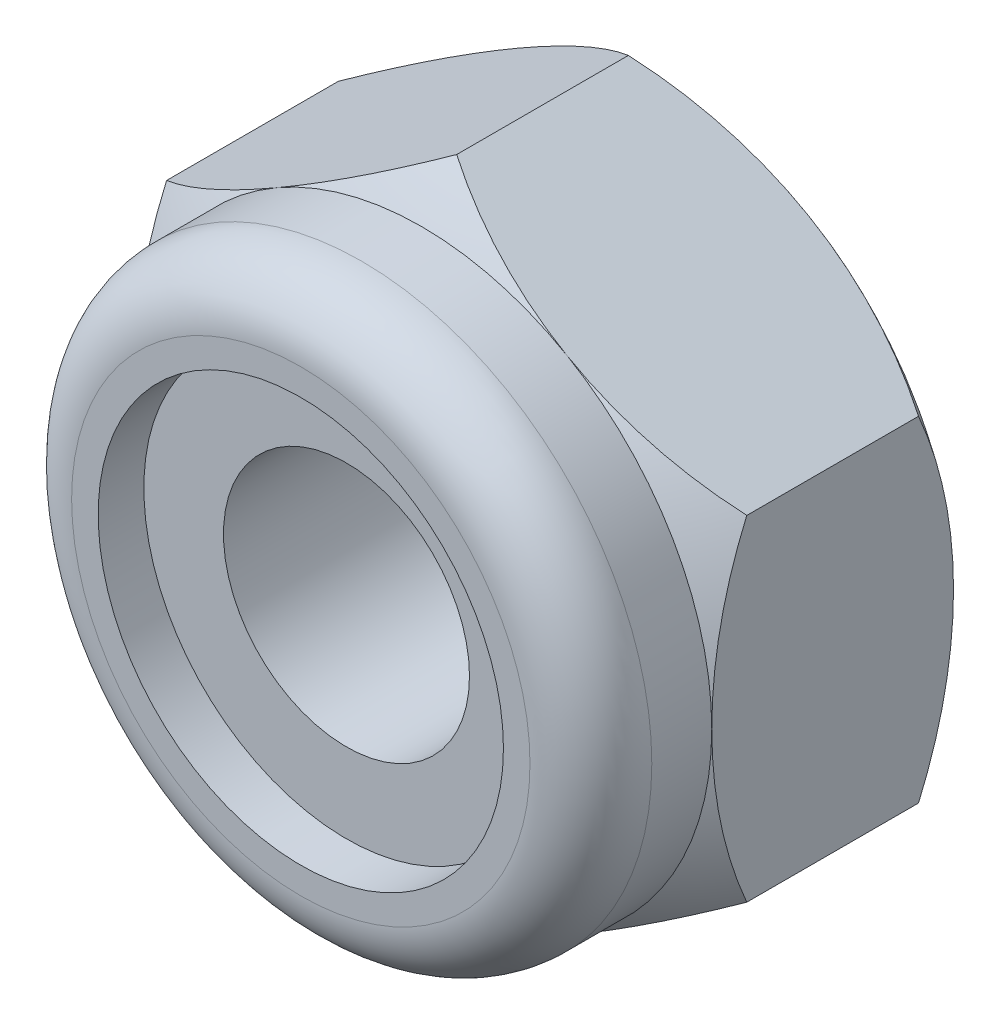
ISO-10303-21;
HEADER;
FILE_DESCRIPTION(('STEP AP214'),'2;1');
FILE_NAME('part.step','',(''),(''),'','','');
FILE_SCHEMA(('AUTOMOTIVE_DESIGN { 1 0 10303 214 1 1 1 1 }'));
ENDSEC;
DATA;
#1=APPLICATION_CONTEXT('core data for automotive mechanical design processes');
#2=APPLICATION_PROTOCOL_DEFINITION('international standard','automotive_design',2000,#1);
#3=PRODUCT_CONTEXT('',#1,'mechanical');
#4=PRODUCT('Part','Part','',(#3));
#5=PRODUCT_RELATED_PRODUCT_CATEGORY('part','',(#4));
#6=PRODUCT_DEFINITION_FORMATION('','',#4);
#7=PRODUCT_DEFINITION_CONTEXT('part definition',#1,'design');
#8=PRODUCT_DEFINITION('design','',#6,#7);
#9=PRODUCT_DEFINITION_SHAPE('','',#8);
#10=(LENGTH_UNIT() NAMED_UNIT(*) SI_UNIT(.MILLI.,.METRE.));
#11=(NAMED_UNIT(*) PLANE_ANGLE_UNIT() SI_UNIT($,.RADIAN.));
#12=(NAMED_UNIT(*) SI_UNIT($,.STERADIAN.) SOLID_ANGLE_UNIT());
#13=UNCERTAINTY_MEASURE_WITH_UNIT(LENGTH_MEASURE(1.E-05),#10,'distance_accuracy_value','');
#14=(GEOMETRIC_REPRESENTATION_CONTEXT(3) GLOBAL_UNCERTAINTY_ASSIGNED_CONTEXT((#13)) GLOBAL_UNIT_ASSIGNED_CONTEXT((#10,
#11,#12)) REPRESENTATION_CONTEXT('',''));
#15=CARTESIAN_POINT('',(0.,0.,0.));
#16=DIRECTION('',(0.,0.,1.));
#17=DIRECTION('',(1.,0.,0.));
#18=AXIS2_PLACEMENT_3D('',#15,#16,#17);
#19=CARTESIAN_POINT('',(0.,0.,4.953125));
#20=DIRECTION('',(0.,0.,1.));
#21=DIRECTION('',(1.,0.,0.));
#22=AXIS2_PLACEMENT_3D('',#19,#20,#21);
#23=TOROIDAL_SURFACE('',#22,3.7625,1.);
#24=CARTESIAN_POINT('',(0.,0.,4.953125));
#25=DIRECTION('',(0.,0.,-1.));
#26=DIRECTION('',(-1.,0.,0.));
#27=AXIS2_PLACEMENT_3D('',#24,#25,#26);
#28=CIRCLE('',#27,4.7625);
#29=CARTESIAN_POINT('',(-4.7625,0.,4.953125));
#30=VERTEX_POINT('',#29);
#31=EDGE_CURVE('E125',#30,#30,#28,.T.);
#32=ORIENTED_EDGE('',*,*,#31,.F.);
#33=EDGE_LOOP('',(#32));
#34=FACE_BOUND('',#33,.T.);
#35=CARTESIAN_POINT('',(0.,0.,5.953125));
#36=DIRECTION('',(0.,0.,-1.));
#37=DIRECTION('',(1.,0.,0.));
#38=AXIS2_PLACEMENT_3D('',#35,#36,#37);
#39=CIRCLE('',#38,3.7625);
#40=CARTESIAN_POINT('',(-3.7625,0.,5.953125));
#41=VERTEX_POINT('',#40);
#42=CARTESIAN_POINT('',(3.7625,0.,5.953125));
#43=VERTEX_POINT('',#42);
#44=EDGE_CURVE('E115',#41,#43,#39,.F.);
#45=ORIENTED_EDGE('',*,*,#44,.F.);
#46=CARTESIAN_POINT('',(0.,0.,5.953125));
#47=DIRECTION('',(0.,0.,-1.));
#48=DIRECTION('',(-1.,0.,0.));
#49=AXIS2_PLACEMENT_3D('',#46,#47,#48);
#50=CIRCLE('',#49,3.7625);
#51=EDGE_CURVE('E119',#43,#41,#50,.F.);
#52=ORIENTED_EDGE('',*,*,#51,.F.);
#53=EDGE_LOOP('',(#45,#52));
#54=FACE_BOUND('',#53,.T.);
#55=ADVANCED_FACE('F17',(#34,#54),#23,.T.);
#56=CARTESIAN_POINT('',(0.,0.,5.953125));
#57=DIRECTION('',(0.,0.,1.));
#58=DIRECTION('',(1.,0.,0.));
#59=AXIS2_PLACEMENT_3D('',#56,#57,#58);
#60=PLANE('',#59);
#61=CARTESIAN_POINT('',(0.,0.,5.953125));
#62=DIRECTION('',(0.,0.,1.));
#63=DIRECTION('',(1.,0.,0.));
#64=AXIS2_PLACEMENT_3D('',#61,#62,#63);
#65=CIRCLE('',#64,3.32676299779793);
#66=CARTESIAN_POINT('',(3.32676299779793,0.,5.953125));
#67=VERTEX_POINT('',#66);
#68=EDGE_CURVE('E271',#67,#67,#65,.F.);
#69=ORIENTED_EDGE('',*,*,#68,.T.);
#70=EDGE_LOOP('',(#69));
#71=FACE_BOUND('',#70,.T.);
#72=ORIENTED_EDGE('',*,*,#51,.T.);
#73=ORIENTED_EDGE('',*,*,#44,.T.);
#74=EDGE_LOOP('',(#72,#73));
#75=FACE_BOUND('',#74,.T.);
#76=ADVANCED_FACE('F124',(#71,#75),#60,.T.);
#77=CARTESIAN_POINT('',(0.,0.,5.953125));
#78=DIRECTION('',(0.,0.,-1.));
#79=DIRECTION('',(-1.,0.,0.));
#80=AXIS2_PLACEMENT_3D('',#77,#78,#79);
#81=CYLINDRICAL_SURFACE('',#80,4.7625);
#82=ORIENTED_EDGE('',*,*,#31,.T.);
#83=EDGE_LOOP('',(#82));
#84=FACE_BOUND('',#83,.T.);
#85=CARTESIAN_POINT('',(0.,0.,3.96875000000001));
#86=DIRECTION('',(0.,0.,-1.));
#87=DIRECTION('',(-1.,0.,0.));
#88=AXIS2_PLACEMENT_3D('',#85,#86,#87);
#89=CIRCLE('',#88,4.7625);
#90=CARTESIAN_POINT('',(2.38124999999999,-4.1244459855234,3.96875000000001));
#91=VERTEX_POINT('',#90);
#92=CARTESIAN_POINT('',(-2.38125,-4.12444598552339,3.96875000000002));
#93=VERTEX_POINT('',#92);
#94=EDGE_CURVE('E108',#91,#93,#89,.T.);
#95=ORIENTED_EDGE('',*,*,#94,.F.);
#96=CARTESIAN_POINT('',(0.,0.,3.96875000000001));
#97=DIRECTION('',(0.,0.,-1.));
#98=DIRECTION('',(-1.,0.,0.));
#99=AXIS2_PLACEMENT_3D('',#96,#97,#98);
#100=CIRCLE('',#99,4.7625);
#101=CARTESIAN_POINT('',(4.76249999999074,0.,3.96875000000645));
#102=VERTEX_POINT('',#101);
#103=EDGE_CURVE('E257',#102,#91,#100,.T.);
#104=ORIENTED_EDGE('',*,*,#103,.F.);
#105=CARTESIAN_POINT('',(0.,0.,3.96875000000001));
#106=DIRECTION('',(0.,0.,-1.));
#107=DIRECTION('',(-1.,0.,0.));
#108=AXIS2_PLACEMENT_3D('',#105,#106,#107);
#109=CIRCLE('',#108,4.7625);
#110=CARTESIAN_POINT('',(2.38125,4.12444598552339,3.96875000000001));
#111=VERTEX_POINT('',#110);
#112=EDGE_CURVE('E259',#111,#102,#109,.T.);
#113=ORIENTED_EDGE('',*,*,#112,.F.);
#114=CARTESIAN_POINT('',(0.,0.,3.96875000000001));
#115=DIRECTION('',(0.,0.,-1.));
#116=DIRECTION('',(-1.,0.,0.));
#117=AXIS2_PLACEMENT_3D('',#114,#115,#116);
#118=CIRCLE('',#117,4.7625);
#119=CARTESIAN_POINT('',(-2.38125,4.12444598552339,3.96875000000001));
#120=VERTEX_POINT('',#119);
#121=EDGE_CURVE('E262',#120,#111,#118,.T.);
#122=ORIENTED_EDGE('',*,*,#121,.F.);
#123=CARTESIAN_POINT('',(0.,0.,3.96875000000001));
#124=DIRECTION('',(0.,0.,-1.));
#125=DIRECTION('',(-1.,0.,0.));
#126=AXIS2_PLACEMENT_3D('',#123,#124,#125);
#127=CIRCLE('',#126,4.7625);
#128=CARTESIAN_POINT('',(-4.76249999999074,0.,3.96875000000645));
#129=VERTEX_POINT('',#128);
#130=EDGE_CURVE('E265',#129,#120,#127,.T.);
#131=ORIENTED_EDGE('',*,*,#130,.F.);
#132=CARTESIAN_POINT('',(0.,0.,3.96875000000001));
#133=DIRECTION('',(0.,0.,-1.));
#134=DIRECTION('',(-1.,0.,0.));
#135=AXIS2_PLACEMENT_3D('',#132,#133,#134);
#136=CIRCLE('',#135,4.7625);
#137=EDGE_CURVE('E268',#93,#129,#136,.T.);
#138=ORIENTED_EDGE('',*,*,#137,.F.);
#139=EDGE_LOOP('',(#95,#104,#113,#122,#131,#138));
#140=FACE_BOUND('',#139,.T.);
#141=ADVANCED_FACE('F143',(#84,#140),#81,.T.);
#142=CARTESIAN_POINT('',(0.,0.,5.953125));
#143=DIRECTION('',(0.,0.,1.));
#144=DIRECTION('',(1.,0.,0.));
#145=AXIS2_PLACEMENT_3D('',#142,#143,#144);
#146=CYLINDRICAL_SURFACE('',#145,3.32676299779793);
#147=CARTESIAN_POINT('',(0.,0.,5.203125));
#148=DIRECTION('',(0.,0.,1.));
#149=DIRECTION('',(1.,0.,0.));
#150=AXIS2_PLACEMENT_3D('',#147,#148,#149);
#151=CIRCLE('',#150,3.32676299779793);
#152=CARTESIAN_POINT('',(3.32676299779793,0.,5.203125));
#153=VERTEX_POINT('',#152);
#154=EDGE_CURVE('E254',#153,#153,#151,.F.);
#155=ORIENTED_EDGE('',*,*,#154,.T.);
#156=EDGE_LOOP('',(#155));
#157=FACE_BOUND('',#156,.T.);
#158=ORIENTED_EDGE('',*,*,#68,.F.);
#159=EDGE_LOOP('',(#158));
#160=FACE_BOUND('',#159,.T.);
#161=ADVANCED_FACE('F278',(#157,#160),#146,.F.);
#162=CARTESIAN_POINT('',(0.,0.,-2.89662617308756));
#163=DIRECTION('',(1.,0.,0.));
#164=DIRECTION('',(0.,-0.514062280042824,0.857752861981336));
#165=AXIS2_PLACEMENT_3D('',#162,#163,#164);
#166=SPHERICAL_SURFACE('',#165,8.35552489362569);
#167=CARTESIAN_POINT('',(2.38125,-4.12444598552339,-2.89662617308756));
#168=DIRECTION('',(0.5,-0.866025403784439,0.));
#169=DIRECTION('',(0.866025403784439,0.5,0.));
#170=AXIS2_PLACEMENT_3D('',#167,#168,#169);
#171=CIRCLE('',#170,6.86537617308758);
#172=CARTESIAN_POINT('',(3.7397602375977E-11,-5.49926131405278,3.39407499989476));
#173=VERTEX_POINT('',#172);
#174=EDGE_CURVE('E249',#91,#173,#171,.T.);
#175=ORIENTED_EDGE('',*,*,#174,.F.);
#176=ORIENTED_EDGE('',*,*,#94,.T.);
#177=CARTESIAN_POINT('',(-2.38125,-4.12444598552339,-2.89662617308756));
#178=DIRECTION('',(-0.5,-0.866025403784439,0.));
#179=DIRECTION('',(0.866025403784439,-0.5,0.));
#180=AXIS2_PLACEMENT_3D('',#177,#178,#179);
#181=CIRCLE('',#180,6.86537617308758);
#182=EDGE_CURVE('E245',#173,#93,#181,.T.);
#183=ORIENTED_EDGE('',*,*,#182,.F.);
#184=EDGE_LOOP('',(#175,#176,#183));
#185=FACE_BOUND('',#184,.T.);
#186=ADVANCED_FACE('F151',(#185),#166,.T.);
#187=CARTESIAN_POINT('',(0.,0.,-2.89662617308763));
#188=DIRECTION('',(1.,0.,0.));
#189=DIRECTION('',(0.,0.00324586478599379,0.999994732167021));
#190=AXIS2_PLACEMENT_3D('',#187,#188,#189);
#191=SPHERICAL_SURFACE('',#190,8.35552489362577);
#192=CARTESIAN_POINT('',(-2.38124999999997,-4.12444598552341,-2.89662617308763));
#193=DIRECTION('',(-0.5,-0.866025403784439,0.));
#194=DIRECTION('',(0.866025403784439,-0.5,0.));
#195=AXIS2_PLACEMENT_3D('',#192,#193,#194);
#196=CIRCLE('',#195,6.86537617308765);
#197=CARTESIAN_POINT('',(-4.7625,-2.74963065700324,3.39407499991903));
#198=VERTEX_POINT('',#197);
#199=EDGE_CURVE('E243',#93,#198,#196,.T.);
#200=ORIENTED_EDGE('',*,*,#199,.F.);
#201=ORIENTED_EDGE('',*,*,#137,.T.);
#202=CARTESIAN_POINT('',(-4.7625,0.,-2.89662617308763));
#203=DIRECTION('',(1.,0.,0.));
#204=DIRECTION('',(0.,0.,-1.));
#205=AXIS2_PLACEMENT_3D('',#202,#203,#204);
#206=CIRCLE('',#205,6.86537617308764);
#207=EDGE_CURVE('E239',#198,#129,#206,.F.);
#208=ORIENTED_EDGE('',*,*,#207,.F.);
#209=EDGE_LOOP('',(#200,#201,#208));
#210=FACE_BOUND('',#209,.T.);
#211=ADVANCED_FACE('F391',(#210),#191,.T.);
#212=CARTESIAN_POINT('',(0.,0.,-2.8966261730876));
#213=DIRECTION('',(1.,0.,0.));
#214=DIRECTION('',(0.,0.517754599312685,0.855529178281233));
#215=AXIS2_PLACEMENT_3D('',#212,#213,#214);
#216=SPHERICAL_SURFACE('',#215,8.35552489362575);
#217=CARTESIAN_POINT('',(-4.76249999998147,0.,-2.8966261730876));
#218=DIRECTION('',(1.,0.,0.));
#219=DIRECTION('',(0.,0.,-1.));
#220=AXIS2_PLACEMENT_3D('',#217,#218,#219);
#221=CIRCLE('',#220,6.86537617310048);
#222=CARTESIAN_POINT('',(-4.76249999994795,2.74963065704565,3.39407499993991));
#223=VERTEX_POINT('',#222);
#224=EDGE_CURVE('E237',#129,#223,#221,.F.);
#225=ORIENTED_EDGE('',*,*,#224,.F.);
#226=ORIENTED_EDGE('',*,*,#130,.T.);
#227=CARTESIAN_POINT('',(-2.38125,4.12444598552339,-2.8966261730876));
#228=DIRECTION('',(-0.5,0.866025403784439,0.));
#229=DIRECTION('',(-0.866025403784439,-0.5,0.));
#230=AXIS2_PLACEMENT_3D('',#227,#228,#229);
#231=CIRCLE('',#230,6.86537617308761);
#232=EDGE_CURVE('E233',#223,#120,#231,.T.);
#233=ORIENTED_EDGE('',*,*,#232,.F.);
#234=EDGE_LOOP('',(#225,#226,#233));
#235=FACE_BOUND('',#234,.T.);
#236=ADVANCED_FACE('F403',(#235),#216,.T.);
#237=CARTESIAN_POINT('',(0.,0.,-2.89662617308755));
#238=DIRECTION('',(1.,0.,0.));
#239=DIRECTION('',(0.,0.658959645209422,0.752178294013775));
#240=AXIS2_PLACEMENT_3D('',#237,#238,#239);
#241=SPHERICAL_SURFACE('',#240,8.35552489362568);
#242=ORIENTED_EDGE('',*,*,#121,.T.);
#243=CARTESIAN_POINT('',(2.38125,4.12444598552339,-2.89662617308755));
#244=DIRECTION('',(0.5,0.866025403784439,0.));
#245=DIRECTION('',(-0.866025403784439,0.5,0.));
#246=AXIS2_PLACEMENT_3D('',#243,#244,#245);
#247=CIRCLE('',#246,6.86537617308756);
#248=CARTESIAN_POINT('',(4.83339496898383E-11,5.49926131400328,3.39407499993803));
#249=VERTEX_POINT('',#248);
#250=EDGE_CURVE('E227',#249,#111,#247,.T.);
#251=ORIENTED_EDGE('',*,*,#250,.F.);
#252=CARTESIAN_POINT('',(-2.38125,4.12444598552339,-2.89662617308755));
#253=DIRECTION('',(-0.5,0.866025403784439,0.));
#254=DIRECTION('',(-0.866025403784439,-0.5,0.));
#255=AXIS2_PLACEMENT_3D('',#252,#253,#254);
#256=CIRCLE('',#255,6.86537617308756);
#257=EDGE_CURVE('E231',#120,#249,#256,.T.);
#258=ORIENTED_EDGE('',*,*,#257,.F.);
#259=EDGE_LOOP('',(#242,#251,#258));
#260=FACE_BOUND('',#259,.T.);
#261=ADVANCED_FACE('F341',(#260),#241,.T.);
#262=CARTESIAN_POINT('',(0.,0.,-2.89662617308758));
#263=DIRECTION('',(1.,0.,0.));
#264=DIRECTION('',(0.,0.517754599312686,0.855529178281232));
#265=AXIS2_PLACEMENT_3D('',#262,#263,#264);
#266=SPHERICAL_SURFACE('',#265,8.35552489362574);
#267=ORIENTED_EDGE('',*,*,#112,.T.);
#268=CARTESIAN_POINT('',(4.76250000000002,0.,-2.89662617308758));
#269=DIRECTION('',(1.,0.,0.));
#270=DIRECTION('',(0.,0.,-1.));
#271=AXIS2_PLACEMENT_3D('',#268,#269,#270);
#272=CIRCLE('',#271,6.86537617308761);
#273=CARTESIAN_POINT('',(4.76250000000002,2.74963065695978,3.39407499993802));
#274=VERTEX_POINT('',#273);
#275=EDGE_CURVE('E221',#274,#102,#272,.T.);
#276=ORIENTED_EDGE('',*,*,#275,.F.);
#277=CARTESIAN_POINT('',(2.38125,4.12444598552339,-2.89662617308758));
#278=DIRECTION('',(0.5,0.866025403784439,0.));
#279=DIRECTION('',(-0.866025403784439,0.5,0.));
#280=AXIS2_PLACEMENT_3D('',#277,#278,#279);
#281=CIRCLE('',#280,6.8653761730876);
#282=EDGE_CURVE('E225',#111,#274,#281,.T.);
#283=ORIENTED_EDGE('',*,*,#282,.F.);
#284=EDGE_LOOP('',(#267,#276,#283));
#285=FACE_BOUND('',#284,.T.);
#286=ADVANCED_FACE('F330',(#285),#266,.T.);
#287=CARTESIAN_POINT('',(0.,0.,-2.89662617308762));
#288=DIRECTION('',(1.,0.,0.));
#289=DIRECTION('',(0.,0.00324586478599379,0.999994732167021));
#290=AXIS2_PLACEMENT_3D('',#287,#288,#289);
#291=SPHERICAL_SURFACE('',#290,8.35552489362576);
#292=ORIENTED_EDGE('',*,*,#103,.T.);
#293=CARTESIAN_POINT('',(2.38124999999997,-4.12444598552341,-2.89662617308762));
#294=DIRECTION('',(0.5,-0.866025403784439,0.));
#295=DIRECTION('',(0.866025403784439,0.5,0.));
#296=AXIS2_PLACEMENT_3D('',#293,#294,#295);
#297=CIRCLE('',#296,6.86537617308765);
#298=CARTESIAN_POINT('',(4.76249999998147,-2.74963065704565,3.39407499991453));
#299=VERTEX_POINT('',#298);
#300=EDGE_CURVE('E251',#299,#91,#297,.T.);
#301=ORIENTED_EDGE('',*,*,#300,.F.);
#302=CARTESIAN_POINT('',(4.76249999998147,0.,-2.89662617308762));
#303=DIRECTION('',(1.,0.,0.));
#304=DIRECTION('',(0.,0.,-1.));
#305=AXIS2_PLACEMENT_3D('',#302,#303,#304);
#306=CIRCLE('',#305,6.86537617310049);
#307=EDGE_CURVE('E218',#102,#299,#306,.T.);
#308=ORIENTED_EDGE('',*,*,#307,.F.);
#309=EDGE_LOOP('',(#292,#301,#308));
#310=FACE_BOUND('',#309,.T.);
#311=ADVANCED_FACE('F325',(#310),#291,.T.);
#312=CARTESIAN_POINT('',(2.01930000000001,0.,5.203125));
#313=DIRECTION('',(0.,0.,-1.));
#314=DIRECTION('',(-1.,0.,0.));
#315=AXIS2_PLACEMENT_3D('',#312,#313,#314);
#316=PLANE('',#315);
#317=ORIENTED_EDGE('',*,*,#154,.F.);
#318=EDGE_LOOP('',(#317));
#319=FACE_BOUND('',#318,.T.);
#320=CARTESIAN_POINT('',(0.,0.,5.203125));
#321=DIRECTION('',(0.,0.,1.));
#322=DIRECTION('',(1.,0.,0.));
#323=AXIS2_PLACEMENT_3D('',#320,#321,#322);
#324=CIRCLE('',#323,2.01930000000001);
#325=CARTESIAN_POINT('',(2.01930000000001,0.,5.203125));
#326=VERTEX_POINT('',#325);
#327=EDGE_CURVE('E214',#326,#326,#324,.F.);
#328=ORIENTED_EDGE('',*,*,#327,.T.);
#329=EDGE_LOOP('',(#328));
#330=FACE_BOUND('',#329,.T.);
#331=ADVANCED_FACE('F322',(#319,#330),#316,.F.);
#332=CARTESIAN_POINT('',(2.38125,-4.12444598552339,1.984375));
#333=DIRECTION('',(0.5,-0.866025403784439,0.));
#334=DIRECTION('',(0.866025403784439,0.5,0.));
#335=AXIS2_PLACEMENT_3D('',#332,#333,#334);
#336=PLANE('',#335);
#337=CARTESIAN_POINT('',(2.38125,-4.12444598552339,6.86537617308756));
#338=DIRECTION('',(0.5,-0.866025403784439,0.));
#339=DIRECTION('',(0.866025403784439,0.5,0.));
#340=AXIS2_PLACEMENT_3D('',#337,#338,#339);
#341=CIRCLE('',#340,6.86537617308756);
#342=CARTESIAN_POINT('',(2.38124999999999,-4.1244459855234,0.));
#343=VERTEX_POINT('',#342);
#344=CARTESIAN_POINT('',(3.7397602375977E-11,-5.49926131405278,0.574675000105257));
#345=VERTEX_POINT('',#344);
#346=EDGE_CURVE('E205',#343,#345,#341,.F.);
#347=ORIENTED_EDGE('',*,*,#346,.F.);
#348=CARTESIAN_POINT('',(2.38124999999998,-4.1244459855234,6.8653761730876));
#349=DIRECTION('',(0.5,-0.866025403784439,0.));
#350=DIRECTION('',(0.866025403784439,0.5,0.));
#351=AXIS2_PLACEMENT_3D('',#348,#349,#350);
#352=CIRCLE('',#351,6.8653761730876);
#353=CARTESIAN_POINT('',(4.76249999999999,-2.7496306570403,0.57467500009718));
#354=VERTEX_POINT('',#353);
#355=EDGE_CURVE('E208',#354,#343,#352,.F.);
#356=ORIENTED_EDGE('',*,*,#355,.F.);
#357=DIRECTION('',(0.,0.,-1.));
#358=VECTOR('',#357,1.);
#359=CARTESIAN_POINT('',(4.7625,-2.749630657065,1.984375));
#360=LINE('',#359,#358);
#361=EDGE_CURVE('E217',#299,#354,#360,.T.);
#362=ORIENTED_EDGE('',*,*,#361,.F.);
#363=ORIENTED_EDGE('',*,*,#300,.T.);
#364=ORIENTED_EDGE('',*,*,#174,.T.);
#365=DIRECTION('',(0.,0.,1.));
#366=VECTOR('',#365,1.);
#367=CARTESIAN_POINT('',(7.4795204751954E-11,-5.49926131407437,1.984375));
#368=LINE('',#367,#366);
#369=EDGE_CURVE('E248',#345,#173,#368,.T.);
#370=ORIENTED_EDGE('',*,*,#369,.F.);
#371=EDGE_LOOP('',(#347,#356,#362,#363,#364,#370));
#372=FACE_BOUND('',#371,.T.);
#373=ADVANCED_FACE('F318',(#372),#336,.T.);
#374=CARTESIAN_POINT('',(-2.38125,-4.12444598552339,1.984375));
#375=DIRECTION('',(-0.5,-0.866025403784439,0.));
#376=DIRECTION('',(0.866025403784439,-0.5,0.));
#377=AXIS2_PLACEMENT_3D('',#374,#375,#376);
#378=PLANE('',#377);
#379=CARTESIAN_POINT('',(-2.38124999999997,-4.12444598552341,6.86537617308762));
#380=DIRECTION('',(-0.5,-0.866025403784439,0.));
#381=DIRECTION('',(0.866025403784439,-0.5,0.));
#382=AXIS2_PLACEMENT_3D('',#379,#380,#381);
#383=CIRCLE('',#382,6.86537617308762);
#384=CARTESIAN_POINT('',(-2.38124999999998,-4.1244459855234,0.));
#385=VERTEX_POINT('',#384);
#386=CARTESIAN_POINT('',(-4.7624999999984,-2.74963065700015,0.57467500007843));
#387=VERTEX_POINT('',#386);
#388=EDGE_CURVE('E196',#385,#387,#383,.F.);
#389=ORIENTED_EDGE('',*,*,#388,.F.);
#390=CARTESIAN_POINT('',(-2.38125,-4.12444598552339,6.86537617308756));
#391=DIRECTION('',(-0.5,-0.866025403784439,0.));
#392=DIRECTION('',(0.866025403784439,-0.5,0.));
#393=AXIS2_PLACEMENT_3D('',#390,#391,#392);
#394=CIRCLE('',#393,6.86537617308756);
#395=EDGE_CURVE('E202',#345,#385,#394,.F.);
#396=ORIENTED_EDGE('',*,*,#395,.F.);
#397=ORIENTED_EDGE('',*,*,#369,.T.);
#398=ORIENTED_EDGE('',*,*,#182,.T.);
#399=ORIENTED_EDGE('',*,*,#199,.T.);
#400=DIRECTION('',(0.,0.,1.));
#401=VECTOR('',#400,1.);
#402=CARTESIAN_POINT('',(-4.7625,-2.74963065699089,1.984375));
#403=LINE('',#402,#401);
#404=EDGE_CURVE('E242',#387,#198,#403,.T.);
#405=ORIENTED_EDGE('',*,*,#404,.F.);
#406=EDGE_LOOP('',(#389,#396,#397,#398,#399,#405));
#407=FACE_BOUND('',#406,.T.);
#408=ADVANCED_FACE('F314',(#407),#378,.T.);
#409=CARTESIAN_POINT('',(-4.7625,0.,1.984375));
#410=DIRECTION('',(-1.,0.,0.));
#411=DIRECTION('',(0.,0.,1.));
#412=AXIS2_PLACEMENT_3D('',#409,#410,#411);
#413=PLANE('',#412);
#414=CARTESIAN_POINT('',(-4.76249999999999,0.,6.86537617308759));
#415=DIRECTION('',(1.,0.,0.));
#416=DIRECTION('',(0.,0.,-1.));
#417=AXIS2_PLACEMENT_3D('',#414,#415,#416);
#418=CIRCLE('',#417,6.86537617308759);
#419=CARTESIAN_POINT('',(-4.76249999999651,0.,-2.40324253553137E-12));
#420=VERTEX_POINT('',#419);
#421=CARTESIAN_POINT('',(-4.76249999995721,2.7496306570403,0.574675000064784));
#422=VERTEX_POINT('',#421);
#423=EDGE_CURVE('E193',#420,#422,#418,.T.);
#424=ORIENTED_EDGE('',*,*,#423,.F.);
#425=CARTESIAN_POINT('',(-4.7624999999861,0.,6.86537617308762));
#426=DIRECTION('',(1.,0.,0.));
#427=DIRECTION('',(0.,0.,-1.));
#428=AXIS2_PLACEMENT_3D('',#425,#426,#427);
#429=CIRCLE('',#428,6.86537617309723);
#430=EDGE_CURVE('E199',#387,#420,#429,.T.);
#431=ORIENTED_EDGE('',*,*,#430,.F.);
#432=ORIENTED_EDGE('',*,*,#404,.T.);
#433=ORIENTED_EDGE('',*,*,#207,.T.);
#434=ORIENTED_EDGE('',*,*,#224,.T.);
#435=DIRECTION('',(0.,0.,1.));
#436=VECTOR('',#435,1.);
#437=CARTESIAN_POINT('',(-4.76249999991443,2.749630657065,1.984375));
#438=LINE('',#437,#436);
#439=EDGE_CURVE('E236',#422,#223,#438,.T.);
#440=ORIENTED_EDGE('',*,*,#439,.F.);
#441=EDGE_LOOP('',(#424,#431,#432,#433,#434,#440));
#442=FACE_BOUND('',#441,.T.);
#443=ADVANCED_FACE('F310',(#442),#413,.T.);
#444=CARTESIAN_POINT('',(-2.38125,4.12444598552339,1.984375));
#445=DIRECTION('',(-0.5,0.866025403784439,0.));
#446=DIRECTION('',(-0.866025403784439,-0.5,0.));
#447=AXIS2_PLACEMENT_3D('',#444,#445,#446);
#448=PLANE('',#447);
#449=CARTESIAN_POINT('',(-2.38125,4.12444598552339,6.86537617308756));
#450=DIRECTION('',(-0.5,0.866025403784439,0.));
#451=DIRECTION('',(-0.866025403784439,-0.5,0.));
#452=AXIS2_PLACEMENT_3D('',#449,#450,#451);
#453=CIRCLE('',#452,6.86537617308756);
#454=CARTESIAN_POINT('',(-2.38125,4.12444598552339,0.));
#455=VERTEX_POINT('',#454);
#456=CARTESIAN_POINT('',(4.8334708631359E-11,5.49926131400328,0.574675000061985));
#457=VERTEX_POINT('',#456);
#458=EDGE_CURVE('E187',#455,#457,#453,.F.);
#459=ORIENTED_EDGE('',*,*,#458,.F.);
#460=CARTESIAN_POINT('',(-2.38124999999999,4.12444598552339,6.86537617308758));
#461=DIRECTION('',(-0.5,0.866025403784439,0.));
#462=DIRECTION('',(-0.866025403784439,-0.5,0.));
#463=AXIS2_PLACEMENT_3D('',#460,#461,#462);
#464=CIRCLE('',#463,6.86537617308758);
#465=EDGE_CURVE('E190',#422,#455,#464,.F.);
#466=ORIENTED_EDGE('',*,*,#465,.F.);
#467=ORIENTED_EDGE('',*,*,#439,.T.);
#468=ORIENTED_EDGE('',*,*,#232,.T.);
#469=ORIENTED_EDGE('',*,*,#257,.T.);
#470=DIRECTION('',(0.,0.,1.));
#471=VECTOR('',#470,1.);
#472=CARTESIAN_POINT('',(9.66692004222836E-11,5.49926131397537,1.984375));
#473=LINE('',#472,#471);
#474=EDGE_CURVE('E230',#457,#249,#473,.T.);
#475=ORIENTED_EDGE('',*,*,#474,.F.);
#476=EDGE_LOOP('',(#459,#466,#467,#468,#469,#475));
#477=FACE_BOUND('',#476,.T.);
#478=ADVANCED_FACE('F307',(#477),#448,.T.);
#479=CARTESIAN_POINT('',(2.38125,4.12444598552339,1.984375));
#480=DIRECTION('',(0.5,0.866025403784439,0.));
#481=DIRECTION('',(-0.866025403784439,0.5,0.));
#482=AXIS2_PLACEMENT_3D('',#479,#480,#481);
#483=PLANE('',#482);
#484=CARTESIAN_POINT('',(2.38125,4.12444598552339,6.86537617308756));
#485=DIRECTION('',(0.5,0.866025403784439,0.));
#486=DIRECTION('',(-0.866025403784439,0.5,0.));
#487=AXIS2_PLACEMENT_3D('',#484,#485,#486);
#488=CIRCLE('',#487,6.86537617308756);
#489=CARTESIAN_POINT('',(2.38125,4.12444598552339,0.));
#490=VERTEX_POINT('',#489);
#491=CARTESIAN_POINT('',(4.7625000000072,2.7496306569577,0.574675000066536));
#492=VERTEX_POINT('',#491);
#493=EDGE_CURVE('E38',#490,#492,#488,.F.);
#494=ORIENTED_EDGE('',*,*,#493,.F.);
#495=CARTESIAN_POINT('',(2.38125,4.12444598552339,6.86537617308756));
#496=DIRECTION('',(0.5,0.866025403784439,0.));
#497=DIRECTION('',(-0.866025403784439,0.5,0.));
#498=AXIS2_PLACEMENT_3D('',#495,#496,#497);
#499=CIRCLE('',#498,6.86537617308756);
#500=EDGE_CURVE('E185',#457,#490,#499,.F.);
#501=ORIENTED_EDGE('',*,*,#500,.F.);
#502=ORIENTED_EDGE('',*,*,#474,.T.);
#503=ORIENTED_EDGE('',*,*,#250,.T.);
#504=ORIENTED_EDGE('',*,*,#282,.T.);
#505=DIRECTION('',(0.,0.,-1.));
#506=VECTOR('',#505,1.);
#507=CARTESIAN_POINT('',(4.7625,2.74963065690397,1.984375));
#508=LINE('',#507,#506);
#509=EDGE_CURVE('E224',#492,#274,#508,.F.);
#510=ORIENTED_EDGE('',*,*,#509,.F.);
#511=EDGE_LOOP('',(#494,#501,#502,#503,#504,#510));
#512=FACE_BOUND('',#511,.T.);
#513=ADVANCED_FACE('F303',(#512),#483,.T.);
#514=CARTESIAN_POINT('',(4.7625,0.,1.984375));
#515=DIRECTION('',(1.,0.,0.));
#516=DIRECTION('',(0.,0.,-1.));
#517=AXIS2_PLACEMENT_3D('',#514,#515,#516);
#518=PLANE('',#517);
#519=CARTESIAN_POINT('',(4.76249999999999,0.,6.8653761730876));
#520=DIRECTION('',(1.,0.,0.));
#521=DIRECTION('',(0.,0.,-1.));
#522=AXIS2_PLACEMENT_3D('',#519,#520,#521);
#523=CIRCLE('',#522,6.86537617308759);
#524=CARTESIAN_POINT('',(4.76250000000179,0.,1.25030194531028E-12));
#525=VERTEX_POINT('',#524);
#526=EDGE_CURVE('E211',#525,#354,#523,.F.);
#527=ORIENTED_EDGE('',*,*,#526,.F.);
#528=CARTESIAN_POINT('',(4.76250000000718,0.,6.86537617308758));
#529=DIRECTION('',(1.,0.,0.));
#530=DIRECTION('',(0.,0.,-1.));
#531=AXIS2_PLACEMENT_3D('',#528,#529,#530);
#532=CIRCLE('',#531,6.86537617308258);
#533=EDGE_CURVE('E181',#492,#525,#532,.F.);
#534=ORIENTED_EDGE('',*,*,#533,.F.);
#535=ORIENTED_EDGE('',*,*,#509,.T.);
#536=ORIENTED_EDGE('',*,*,#275,.T.);
#537=ORIENTED_EDGE('',*,*,#307,.T.);
#538=ORIENTED_EDGE('',*,*,#361,.T.);
#539=EDGE_LOOP('',(#527,#534,#535,#536,#537,#538));
#540=FACE_BOUND('',#539,.T.);
#541=ADVANCED_FACE('F299',(#540),#518,.T.);
#542=CARTESIAN_POINT('',(0.,0.,5.953125));
#543=DIRECTION('',(0.,0.,1.));
#544=DIRECTION('',(1.,0.,0.));
#545=AXIS2_PLACEMENT_3D('',#542,#543,#544);
#546=CYLINDRICAL_SURFACE('',#545,2.01930000000001);
#547=CARTESIAN_POINT('',(0.,0.,0.));
#548=DIRECTION('',(0.,0.,1.));
#549=DIRECTION('',(1.,0.,0.));
#550=AXIS2_PLACEMENT_3D('',#547,#548,#549);
#551=CIRCLE('',#550,2.01930000000001);
#552=CARTESIAN_POINT('',(2.01930000000001,0.,0.));
#553=VERTEX_POINT('',#552);
#554=EDGE_CURVE('E178',#553,#553,#551,.T.);
#555=ORIENTED_EDGE('',*,*,#554,.F.);
#556=EDGE_LOOP('',(#555));
#557=FACE_BOUND('',#556,.T.);
#558=ORIENTED_EDGE('',*,*,#327,.F.);
#559=EDGE_LOOP('',(#558));
#560=FACE_BOUND('',#559,.T.);
#561=ADVANCED_FACE('F295',(#557,#560),#546,.F.);
#562=CARTESIAN_POINT('',(0.,0.,6.8653761730876));
#563=DIRECTION('',(1.,0.,0.));
#564=DIRECTION('',(0.,-0.517754599312681,-0.855529178281235));
#565=AXIS2_PLACEMENT_3D('',#562,#563,#564);
#566=SPHERICAL_SURFACE('',#565,8.3555248936257);
#567=ORIENTED_EDGE('',*,*,#355,.T.);
#568=CARTESIAN_POINT('',(0.,0.,0.));
#569=DIRECTION('',(0.,0.,-1.));
#570=DIRECTION('',(-1.,0.,0.));
#571=AXIS2_PLACEMENT_3D('',#568,#569,#570);
#572=CIRCLE('',#571,4.76249999999999);
#573=EDGE_CURVE('E175',#525,#343,#572,.T.);
#574=ORIENTED_EDGE('',*,*,#573,.F.);
#575=ORIENTED_EDGE('',*,*,#526,.T.);
#576=EDGE_LOOP('',(#567,#574,#575));
#577=FACE_BOUND('',#576,.T.);
#578=ADVANCED_FACE('F298',(#577),#566,.T.);
#579=CARTESIAN_POINT('',(0.,0.,6.86537617308756));
#580=DIRECTION('',(1.,0.,0.));
#581=DIRECTION('',(0.,-0.658959645214411,-0.752178294009404));
#582=AXIS2_PLACEMENT_3D('',#579,#580,#581);
#583=SPHERICAL_SURFACE('',#582,8.35552489362568);
#584=ORIENTED_EDGE('',*,*,#395,.T.);
#585=CARTESIAN_POINT('',(0.,0.,0.));
#586=DIRECTION('',(0.,0.,-1.));
#587=DIRECTION('',(-1.,0.,0.));
#588=AXIS2_PLACEMENT_3D('',#585,#586,#587);
#589=CIRCLE('',#588,4.7625);
#590=EDGE_CURVE('E172',#343,#385,#589,.T.);
#591=ORIENTED_EDGE('',*,*,#590,.F.);
#592=ORIENTED_EDGE('',*,*,#346,.T.);
#593=EDGE_LOOP('',(#584,#591,#592));
#594=FACE_BOUND('',#593,.T.);
#595=ADVANCED_FACE('F348',(#594),#583,.T.);
#596=CARTESIAN_POINT('',(0.,0.,6.86537617308762));
#597=DIRECTION('',(1.,0.,0.));
#598=DIRECTION('',(0.,-0.517754599312678,-0.855529178281237));
#599=AXIS2_PLACEMENT_3D('',#596,#597,#598);
#600=SPHERICAL_SURFACE('',#599,8.35552489362571);
#601=CARTESIAN_POINT('',(0.,0.,0.));
#602=DIRECTION('',(0.,0.,-1.));
#603=DIRECTION('',(-1.,0.,0.));
#604=AXIS2_PLACEMENT_3D('',#601,#602,#603);
#605=CIRCLE('',#604,4.76249999999997);
#606=EDGE_CURVE('E169',#385,#420,#605,.T.);
#607=ORIENTED_EDGE('',*,*,#606,.F.);
#608=ORIENTED_EDGE('',*,*,#388,.T.);
#609=ORIENTED_EDGE('',*,*,#430,.T.);
#610=EDGE_LOOP('',(#607,#608,#609));
#611=FACE_BOUND('',#610,.T.);
#612=ADVANCED_FACE('F352',(#611),#600,.T.);
#613=CARTESIAN_POINT('',(0.,0.,6.86537617308758));
#614=DIRECTION('',(1.,0.,0.));
#615=DIRECTION('',(0.,-0.00324586478599368,-0.999994732167021));
#616=AXIS2_PLACEMENT_3D('',#613,#614,#615);
#617=SPHERICAL_SURFACE('',#616,8.3555248936257);
#618=ORIENTED_EDGE('',*,*,#465,.T.);
#619=CARTESIAN_POINT('',(0.,0.,0.));
#620=DIRECTION('',(0.,0.,-1.));
#621=DIRECTION('',(-1.,0.,0.));
#622=AXIS2_PLACEMENT_3D('',#619,#620,#621);
#623=CIRCLE('',#622,4.76250000000001);
#624=EDGE_CURVE('E166',#420,#455,#623,.T.);
#625=ORIENTED_EDGE('',*,*,#624,.F.);
#626=ORIENTED_EDGE('',*,*,#423,.T.);
#627=EDGE_LOOP('',(#618,#625,#626));
#628=FACE_BOUND('',#627,.T.);
#629=ADVANCED_FACE('F356',(#628),#617,.T.);
#630=CARTESIAN_POINT('',(0.,0.,6.86537617308756));
#631=DIRECTION('',(1.,0.,0.));
#632=DIRECTION('',(0.,0.51406228004279,-0.857752861981356));
#633=AXIS2_PLACEMENT_3D('',#630,#631,#632);
#634=SPHERICAL_SURFACE('',#633,8.35552489362568);
#635=ORIENTED_EDGE('',*,*,#500,.T.);
#636=CARTESIAN_POINT('',(0.,0.,0.));
#637=DIRECTION('',(0.,0.,-1.));
#638=DIRECTION('',(-1.,0.,0.));
#639=AXIS2_PLACEMENT_3D('',#636,#637,#638);
#640=CIRCLE('',#639,4.76250000000001);
#641=EDGE_CURVE('E29',#455,#490,#640,.T.);
#642=ORIENTED_EDGE('',*,*,#641,.F.);
#643=ORIENTED_EDGE('',*,*,#458,.T.);
#644=EDGE_LOOP('',(#635,#642,#643));
#645=FACE_BOUND('',#644,.T.);
#646=ADVANCED_FACE('F291',(#645),#634,.T.);
#647=CARTESIAN_POINT('',(0.,0.,6.86537617308756));
#648=DIRECTION('',(1.,0.,0.));
#649=DIRECTION('',(0.,-0.00324586478599372,-0.999994732167021));
#650=AXIS2_PLACEMENT_3D('',#647,#648,#649);
#651=SPHERICAL_SURFACE('',#650,8.35552489362567);
#652=ORIENTED_EDGE('',*,*,#533,.T.);
#653=CARTESIAN_POINT('',(0.,0.,0.));
#654=DIRECTION('',(0.,0.,-1.));
#655=DIRECTION('',(-1.,0.,0.));
#656=AXIS2_PLACEMENT_3D('',#653,#654,#655);
#657=CIRCLE('',#656,4.7625);
#658=EDGE_CURVE('E11',#490,#525,#657,.T.);
#659=ORIENTED_EDGE('',*,*,#658,.F.);
#660=ORIENTED_EDGE('',*,*,#493,.T.);
#661=EDGE_LOOP('',(#652,#659,#660));
#662=FACE_BOUND('',#661,.T.);
#663=ADVANCED_FACE('F19',(#662),#651,.T.);
#664=CARTESIAN_POINT('',(0.,0.,0.));
#665=DIRECTION('',(0.,0.,-1.));
#666=DIRECTION('',(-1.,0.,0.));
#667=AXIS2_PLACEMENT_3D('',#664,#665,#666);
#668=PLANE('',#667);
#669=ORIENTED_EDGE('',*,*,#641,.T.);
#670=ORIENTED_EDGE('',*,*,#658,.T.);
#671=ORIENTED_EDGE('',*,*,#573,.T.);
#672=ORIENTED_EDGE('',*,*,#590,.T.);
#673=ORIENTED_EDGE('',*,*,#606,.T.);
#674=ORIENTED_EDGE('',*,*,#624,.T.);
#675=EDGE_LOOP('',(#669,#670,#671,#672,#673,#674));
#676=FACE_BOUND('',#675,.T.);
#677=ORIENTED_EDGE('',*,*,#554,.T.);
#678=EDGE_LOOP('',(#677));
#679=FACE_BOUND('',#678,.T.);
#680=ADVANCED_FACE('F284',(#676,#679),#668,.T.);
#681=CLOSED_SHELL('',(#55,#76,#141,#161,#186,#211,#236,#261,#286,#311,#331,#373,#408,#443,#478,
#513,#541,#561,#578,#595,#612,#629,#646,#663,#680));
#682=MANIFOLD_SOLID_BREP('B1',#681);
#683=ADVANCED_BREP_SHAPE_REPRESENTATION('',(#18,#682),#14);
#684=SHAPE_DEFINITION_REPRESENTATION(#9,#683);
ENDSEC;
END-ISO-10303-21;
